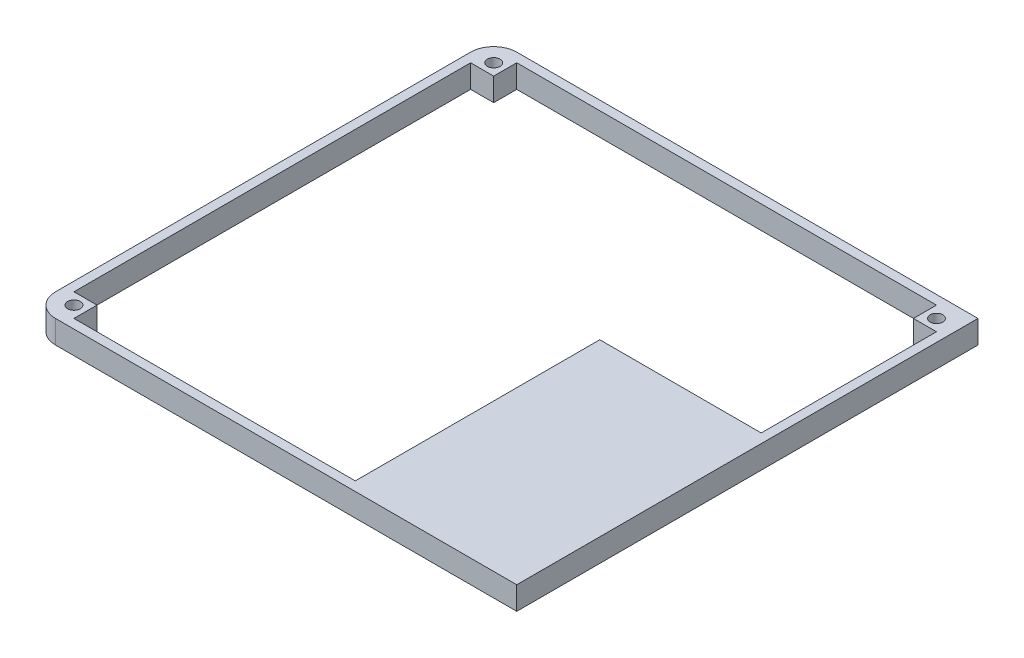
ISO-10303-21;
HEADER;
FILE_DESCRIPTION(('STEP AP214'),'2;1');
FILE_NAME('part.step','',(''),(''),'','','');
FILE_SCHEMA(('AUTOMOTIVE_DESIGN { 1 0 10303 214 1 1 1 1 }'));
ENDSEC;
DATA;
#1=APPLICATION_CONTEXT('core data for automotive mechanical design processes');
#2=APPLICATION_PROTOCOL_DEFINITION('international standard','automotive_design',2000,#1);
#3=PRODUCT_CONTEXT('',#1,'mechanical');
#4=PRODUCT('Part','Part','',(#3));
#5=PRODUCT_RELATED_PRODUCT_CATEGORY('part','',(#4));
#6=PRODUCT_DEFINITION_FORMATION('','',#4);
#7=PRODUCT_DEFINITION_CONTEXT('part definition',#1,'design');
#8=PRODUCT_DEFINITION('design','',#6,#7);
#9=PRODUCT_DEFINITION_SHAPE('','',#8);
#10=(LENGTH_UNIT() NAMED_UNIT(*) SI_UNIT(.MILLI.,.METRE.));
#11=(NAMED_UNIT(*) PLANE_ANGLE_UNIT() SI_UNIT($,.RADIAN.));
#12=(NAMED_UNIT(*) SI_UNIT($,.STERADIAN.) SOLID_ANGLE_UNIT());
#13=UNCERTAINTY_MEASURE_WITH_UNIT(LENGTH_MEASURE(1.E-05),#10,'distance_accuracy_value','');
#14=(GEOMETRIC_REPRESENTATION_CONTEXT(3) GLOBAL_UNCERTAINTY_ASSIGNED_CONTEXT((#13)) GLOBAL_UNIT_ASSIGNED_CONTEXT((#10,
#11,#12)) REPRESENTATION_CONTEXT('',''));
#15=CARTESIAN_POINT('',(0.,0.,0.));
#16=DIRECTION('',(0.,0.,1.));
#17=DIRECTION('',(1.,0.,0.));
#18=AXIS2_PLACEMENT_3D('',#15,#16,#17);
#19=CARTESIAN_POINT('',(206.,-10.,-196.));
#20=DIRECTION('',(1.,0.,0.));
#21=DIRECTION('',(0.,0.,-1.));
#22=AXIS2_PLACEMENT_3D('',#19,#20,#21);
#23=PLANE('',#22);
#24=DIRECTION('',(0.,-1.,0.));
#25=VECTOR('',#24,1.);
#26=CARTESIAN_POINT('',(206.,0.,-106.));
#27=LINE('',#26,#25);
#28=CARTESIAN_POINT('',(206.,-5.,-106.));
#29=VERTEX_POINT('',#28);
#30=CARTESIAN_POINT('',(206.,-10.,-106.));
#31=VERTEX_POINT('',#30);
#32=EDGE_CURVE('E417',#29,#31,#27,.T.);
#33=ORIENTED_EDGE('',*,*,#32,.T.);
#34=DIRECTION('',(0.,0.,-1.));
#35=VECTOR('',#34,1.);
#36=CARTESIAN_POINT('',(206.,-10.,-196.));
#37=LINE('',#36,#35);
#38=CARTESIAN_POINT('',(206.,-10.,-4.));
#39=VERTEX_POINT('',#38);
#40=EDGE_CURVE('E235',#39,#31,#37,.T.);
#41=ORIENTED_EDGE('',*,*,#40,.F.);
#42=DIRECTION('',(0.,-1.,0.));
#43=VECTOR('',#42,1.);
#44=CARTESIAN_POINT('',(206.,-5.,-4.));
#45=LINE('',#44,#43);
#46=CARTESIAN_POINT('',(206.,-5.,-4.));
#47=VERTEX_POINT('',#46);
#48=EDGE_CURVE('E252',#47,#39,#45,.T.);
#49=ORIENTED_EDGE('',*,*,#48,.F.);
#50=DIRECTION('',(0.,0.,1.));
#51=VECTOR('',#50,1.);
#52=CARTESIAN_POINT('',(206.,-5.,-4.));
#53=LINE('',#52,#51);
#54=EDGE_CURVE('E406',#29,#47,#53,.T.);
#55=ORIENTED_EDGE('',*,*,#54,.F.);
#56=EDGE_LOOP('',(#33,#41,#49,#55));
#57=FACE_BOUND('',#56,.T.);
#58=ADVANCED_FACE('F45',(#57),#23,.F.);
#59=DIRECTION('',(0.,-1.,0.));
#60=VECTOR('',#59,1.);
#61=CARTESIAN_POINT('',(206.,0.,-110.));
#62=LINE('',#61,#60);
#63=CARTESIAN_POINT('',(206.,0.,-110.));
#64=VERTEX_POINT('',#63);
#65=CARTESIAN_POINT('',(206.,-10.,-110.));
#66=VERTEX_POINT('',#65);
#67=EDGE_CURVE('E437',#64,#66,#62,.T.);
#68=ORIENTED_EDGE('',*,*,#67,.F.);
#69=DIRECTION('',(0.,0.,-1.));
#70=VECTOR('',#69,1.);
#71=CARTESIAN_POINT('',(206.,0.,-196.));
#72=LINE('',#71,#70);
#73=CARTESIAN_POINT('',(206.,0.,-186.));
#74=VERTEX_POINT('',#73);
#75=EDGE_CURVE('E255',#64,#74,#72,.T.);
#76=ORIENTED_EDGE('',*,*,#75,.T.);
#77=DIRECTION('',(0.,-1.,0.));
#78=VECTOR('',#77,1.);
#79=CARTESIAN_POINT('',(206.,0.,-186.));
#80=LINE('',#79,#78);
#81=CARTESIAN_POINT('',(206.,-10.,-186.));
#82=VERTEX_POINT('',#81);
#83=EDGE_CURVE('E506',#74,#82,#80,.T.);
#84=ORIENTED_EDGE('',*,*,#83,.T.);
#85=EDGE_CURVE('E230',#66,#82,#37,.T.);
#86=ORIENTED_EDGE('',*,*,#85,.F.);
#87=EDGE_LOOP('',(#68,#76,#84,#86));
#88=FACE_BOUND('',#87,.T.);
#89=ADVANCED_FACE('F348',(#88),#23,.F.);
#90=CARTESIAN_POINT('',(4.00000000000002,-10.,-4.));
#91=DIRECTION('',(0.,0.,1.));
#92=DIRECTION('',(1.,0.,0.));
#93=AXIS2_PLACEMENT_3D('',#90,#91,#92);
#94=PLANE('',#93);
#95=DIRECTION('',(0.,-1.,0.));
#96=VECTOR('',#95,1.);
#97=CARTESIAN_POINT('',(140.,0.,-4.));
#98=LINE('',#97,#96);
#99=CARTESIAN_POINT('',(140.,-5.,-4.));
#100=VERTEX_POINT('',#99);
#101=CARTESIAN_POINT('',(140.,-10.,-4.));
#102=VERTEX_POINT('',#101);
#103=EDGE_CURVE('E390',#100,#102,#98,.T.);
#104=ORIENTED_EDGE('',*,*,#103,.F.);
#105=DIRECTION('',(-1.,0.,0.));
#106=VECTOR('',#105,1.);
#107=CARTESIAN_POINT('',(140.,-5.,-4.));
#108=LINE('',#107,#106);
#109=EDGE_CURVE('E393',#47,#100,#108,.T.);
#110=ORIENTED_EDGE('',*,*,#109,.F.);
#111=ORIENTED_EDGE('',*,*,#48,.T.);
#112=DIRECTION('',(1.,0.,0.));
#113=VECTOR('',#112,1.);
#114=CARTESIAN_POINT('',(4.00000000000002,-10.,-4.));
#115=LINE('',#114,#113);
#116=EDGE_CURVE('E231',#102,#39,#115,.T.);
#117=ORIENTED_EDGE('',*,*,#116,.F.);
#118=EDGE_LOOP('',(#104,#110,#111,#117));
#119=FACE_BOUND('',#118,.T.);
#120=ADVANCED_FACE('F354',(#119),#94,.F.);
#121=CARTESIAN_POINT('',(0.,-10.,0.));
#122=DIRECTION('',(-1.,0.,0.));
#123=DIRECTION('',(0.,0.,1.));
#124=AXIS2_PLACEMENT_3D('',#121,#122,#123);
#125=PLANE('',#124);
#126=DIRECTION('',(0.,0.,1.));
#127=VECTOR('',#126,1.);
#128=CARTESIAN_POINT('',(0.,-10.,0.));
#129=LINE('',#128,#127);
#130=CARTESIAN_POINT('',(0.,-10.,-190.));
#131=VERTEX_POINT('',#130);
#132=CARTESIAN_POINT('',(0.,-10.,-10.));
#133=VERTEX_POINT('',#132);
#134=EDGE_CURVE('E262',#131,#133,#129,.T.);
#135=ORIENTED_EDGE('',*,*,#134,.T.);
#136=DIRECTION('',(0.,1.,0.));
#137=VECTOR('',#136,1.);
#138=CARTESIAN_POINT('',(0.,-10.,-10.));
#139=LINE('',#138,#137);
#140=CARTESIAN_POINT('',(0.,0.,-10.));
#141=VERTEX_POINT('',#140);
#142=EDGE_CURVE('E299',#133,#141,#139,.T.);
#143=ORIENTED_EDGE('',*,*,#142,.T.);
#144=DIRECTION('',(0.,0.,1.));
#145=VECTOR('',#144,1.);
#146=CARTESIAN_POINT('',(0.,0.,0.));
#147=LINE('',#146,#145);
#148=CARTESIAN_POINT('',(0.,0.,-190.));
#149=VERTEX_POINT('',#148);
#150=EDGE_CURVE('E247',#149,#141,#147,.T.);
#151=ORIENTED_EDGE('',*,*,#150,.F.);
#152=DIRECTION('',(0.,1.,0.));
#153=VECTOR('',#152,1.);
#154=CARTESIAN_POINT('',(0.,-10.,-190.));
#155=LINE('',#154,#153);
#156=EDGE_CURVE('E293',#149,#131,#155,.F.);
#157=ORIENTED_EDGE('',*,*,#156,.T.);
#158=EDGE_LOOP('',(#135,#143,#151,#157));
#159=FACE_BOUND('',#158,.T.);
#160=ADVANCED_FACE('F319',(#159),#125,.T.);
#161=CARTESIAN_POINT('',(0.,-10.,-200.));
#162=DIRECTION('',(0.,0.,-1.));
#163=DIRECTION('',(-1.,0.,0.));
#164=AXIS2_PLACEMENT_3D('',#161,#162,#163);
#165=PLANE('',#164);
#166=DIRECTION('',(-1.,0.,0.));
#167=VECTOR('',#166,1.);
#168=CARTESIAN_POINT('',(0.,-10.,-200.));
#169=LINE('',#168,#167);
#170=CARTESIAN_POINT('',(210.,-10.,-200.));
#171=VERTEX_POINT('',#170);
#172=CARTESIAN_POINT('',(10.,-10.,-200.));
#173=VERTEX_POINT('',#172);
#174=EDGE_CURVE('E273',#171,#173,#169,.T.);
#175=ORIENTED_EDGE('',*,*,#174,.T.);
#176=DIRECTION('',(0.,1.,0.));
#177=VECTOR('',#176,1.);
#178=CARTESIAN_POINT('',(10.,-10.,-200.));
#179=LINE('',#178,#177);
#180=CARTESIAN_POINT('',(10.,0.,-200.));
#181=VERTEX_POINT('',#180);
#182=EDGE_CURVE('E11',#173,#181,#179,.T.);
#183=ORIENTED_EDGE('',*,*,#182,.T.);
#184=DIRECTION('',(-1.,0.,0.));
#185=VECTOR('',#184,1.);
#186=CARTESIAN_POINT('',(0.,0.,-200.));
#187=LINE('',#186,#185);
#188=CARTESIAN_POINT('',(210.,0.,-200.));
#189=VERTEX_POINT('',#188);
#190=EDGE_CURVE('E267',#189,#181,#187,.T.);
#191=ORIENTED_EDGE('',*,*,#190,.F.);
#192=DIRECTION('',(0.,1.,0.));
#193=VECTOR('',#192,1.);
#194=CARTESIAN_POINT('',(210.,-10.,-200.));
#195=LINE('',#194,#193);
#196=EDGE_CURVE('E289',#171,#189,#195,.T.);
#197=ORIENTED_EDGE('',*,*,#196,.F.);
#198=EDGE_LOOP('',(#175,#183,#191,#197));
#199=FACE_BOUND('',#198,.T.);
#200=ADVANCED_FACE('F334',(#199),#165,.T.);
#201=CARTESIAN_POINT('',(210.,-10.,0.));
#202=DIRECTION('',(1.,0.,0.));
#203=DIRECTION('',(0.,0.,-1.));
#204=AXIS2_PLACEMENT_3D('',#201,#202,#203);
#205=PLANE('',#204);
#206=ORIENTED_EDGE('',*,*,#196,.T.);
#207=DIRECTION('',(0.,0.,-1.));
#208=VECTOR('',#207,1.);
#209=CARTESIAN_POINT('',(210.,0.,0.));
#210=LINE('',#209,#208);
#211=CARTESIAN_POINT('',(210.,0.,0.));
#212=VERTEX_POINT('',#211);
#213=EDGE_CURVE('E283',#212,#189,#210,.T.);
#214=ORIENTED_EDGE('',*,*,#213,.F.);
#215=DIRECTION('',(0.,1.,0.));
#216=VECTOR('',#215,1.);
#217=CARTESIAN_POINT('',(210.,-10.,0.));
#218=LINE('',#217,#216);
#219=CARTESIAN_POINT('',(210.,-10.,0.));
#220=VERTEX_POINT('',#219);
#221=EDGE_CURVE('E276',#220,#212,#218,.T.);
#222=ORIENTED_EDGE('',*,*,#221,.F.);
#223=DIRECTION('',(0.,0.,-1.));
#224=VECTOR('',#223,1.);
#225=CARTESIAN_POINT('',(210.,-10.,0.));
#226=LINE('',#225,#224);
#227=EDGE_CURVE('E270',#220,#171,#226,.T.);
#228=ORIENTED_EDGE('',*,*,#227,.T.);
#229=EDGE_LOOP('',(#206,#214,#222,#228));
#230=FACE_BOUND('',#229,.T.);
#231=ADVANCED_FACE('F330',(#230),#205,.T.);
#232=CARTESIAN_POINT('',(0.,-10.,0.));
#233=DIRECTION('',(0.,0.,1.));
#234=DIRECTION('',(1.,0.,0.));
#235=AXIS2_PLACEMENT_3D('',#232,#233,#234);
#236=PLANE('',#235);
#237=DIRECTION('',(1.,0.,0.));
#238=VECTOR('',#237,1.);
#239=CARTESIAN_POINT('',(0.,0.,0.));
#240=LINE('',#239,#238);
#241=CARTESIAN_POINT('',(10.,0.,0.));
#242=VERTEX_POINT('',#241);
#243=EDGE_CURVE('E280',#242,#212,#240,.T.);
#244=ORIENTED_EDGE('',*,*,#243,.F.);
#245=DIRECTION('',(0.,1.,0.));
#246=VECTOR('',#245,1.);
#247=CARTESIAN_POINT('',(10.,-10.,0.));
#248=LINE('',#247,#246);
#249=CARTESIAN_POINT('',(10.,-10.,0.));
#250=VERTEX_POINT('',#249);
#251=EDGE_CURVE('E69',#242,#250,#248,.F.);
#252=ORIENTED_EDGE('',*,*,#251,.T.);
#253=DIRECTION('',(1.,0.,0.));
#254=VECTOR('',#253,1.);
#255=CARTESIAN_POINT('',(0.,-10.,0.));
#256=LINE('',#255,#254);
#257=EDGE_CURVE('E266',#250,#220,#256,.T.);
#258=ORIENTED_EDGE('',*,*,#257,.T.);
#259=ORIENTED_EDGE('',*,*,#221,.T.);
#260=EDGE_LOOP('',(#244,#252,#258,#259));
#261=FACE_BOUND('',#260,.T.);
#262=ADVANCED_FACE('F326',(#261),#236,.T.);
#263=CARTESIAN_POINT('',(0.,-10.,0.));
#264=DIRECTION('',(0.,-1.,0.));
#265=DIRECTION('',(0.,0.,-1.));
#266=AXIS2_PLACEMENT_3D('',#263,#264,#265);
#267=PLANE('',#266);
#268=DIRECTION('',(-1.,0.,0.));
#269=VECTOR('',#268,1.);
#270=CARTESIAN_POINT('',(0.,-10.,-110.));
#271=LINE('',#270,#269);
#272=CARTESIAN_POINT('',(136.,-10.,-110.));
#273=VERTEX_POINT('',#272);
#274=EDGE_CURVE('E210',#66,#273,#271,.T.);
#275=ORIENTED_EDGE('',*,*,#274,.F.);
#276=ORIENTED_EDGE('',*,*,#85,.T.);
#277=DIRECTION('',(-1.,0.,0.));
#278=VECTOR('',#277,1.);
#279=CARTESIAN_POINT('',(206.,-10.,-186.));
#280=LINE('',#279,#278);
#281=CARTESIAN_POINT('',(196.,-10.,-186.));
#282=VERTEX_POINT('',#281);
#283=EDGE_CURVE('E520',#82,#282,#280,.T.);
#284=ORIENTED_EDGE('',*,*,#283,.T.);
#285=DIRECTION('',(0.,0.,-1.));
#286=VECTOR('',#285,1.);
#287=CARTESIAN_POINT('',(196.,-10.,-196.));
#288=LINE('',#287,#286);
#289=CARTESIAN_POINT('',(196.,-10.,-196.));
#290=VERTEX_POINT('',#289);
#291=EDGE_CURVE('E516',#282,#290,#288,.T.);
#292=ORIENTED_EDGE('',*,*,#291,.T.);
#293=DIRECTION('',(-1.,0.,0.));
#294=VECTOR('',#293,1.);
#295=CARTESIAN_POINT('',(4.,-10.,-196.));
#296=LINE('',#295,#294);
#297=CARTESIAN_POINT('',(14.,-10.,-196.));
#298=VERTEX_POINT('',#297);
#299=EDGE_CURVE('E243',#290,#298,#296,.T.);
#300=ORIENTED_EDGE('',*,*,#299,.T.);
#301=DIRECTION('',(0.,0.,1.));
#302=VECTOR('',#301,1.);
#303=CARTESIAN_POINT('',(14.,-10.,-196.));
#304=LINE('',#303,#302);
#305=CARTESIAN_POINT('',(14.,-10.,-186.));
#306=VERTEX_POINT('',#305);
#307=EDGE_CURVE('E489',#298,#306,#304,.T.);
#308=ORIENTED_EDGE('',*,*,#307,.T.);
#309=DIRECTION('',(-1.,0.,0.));
#310=VECTOR('',#309,1.);
#311=CARTESIAN_POINT('',(4.,-10.,-186.));
#312=LINE('',#311,#310);
#313=CARTESIAN_POINT('',(4.,-10.,-186.));
#314=VERTEX_POINT('',#313);
#315=EDGE_CURVE('E485',#306,#314,#312,.T.);
#316=ORIENTED_EDGE('',*,*,#315,.T.);
#317=DIRECTION('',(0.,0.,1.));
#318=VECTOR('',#317,1.);
#319=CARTESIAN_POINT('',(4.,-10.,-196.));
#320=LINE('',#319,#318);
#321=CARTESIAN_POINT('',(4.00000000000002,-10.,-14.));
#322=VERTEX_POINT('',#321);
#323=EDGE_CURVE('E237',#314,#322,#320,.T.);
#324=ORIENTED_EDGE('',*,*,#323,.T.);
#325=DIRECTION('',(1.,0.,0.));
#326=VECTOR('',#325,1.);
#327=CARTESIAN_POINT('',(4.00000000000002,-10.,-14.));
#328=LINE('',#327,#326);
#329=CARTESIAN_POINT('',(14.,-10.,-14.));
#330=VERTEX_POINT('',#329);
#331=EDGE_CURVE('E446',#322,#330,#328,.T.);
#332=ORIENTED_EDGE('',*,*,#331,.T.);
#333=DIRECTION('',(0.,0.,1.));
#334=VECTOR('',#333,1.);
#335=CARTESIAN_POINT('',(14.,-10.,-4.));
#336=LINE('',#335,#334);
#337=CARTESIAN_POINT('',(14.,-10.,-4.));
#338=VERTEX_POINT('',#337);
#339=EDGE_CURVE('E227',#330,#338,#336,.T.);
#340=ORIENTED_EDGE('',*,*,#339,.T.);
#341=CARTESIAN_POINT('',(136.,-10.,-4.00000000000001));
#342=VERTEX_POINT('',#341);
#343=EDGE_CURVE('E217',#338,#342,#115,.T.);
#344=ORIENTED_EDGE('',*,*,#343,.T.);
#345=DIRECTION('',(0.,0.,-1.));
#346=VECTOR('',#345,1.);
#347=CARTESIAN_POINT('',(136.,-10.,0.));
#348=LINE('',#347,#346);
#349=EDGE_CURVE('E197',#342,#273,#348,.T.);
#350=ORIENTED_EDGE('',*,*,#349,.T.);
#351=EDGE_LOOP('',(#275,#276,#284,#292,#300,#308,#316,#324,#332,#340,#344,#350));
#352=FACE_BOUND('',#351,.T.);
#353=ORIENTED_EDGE('',*,*,#40,.T.);
#354=DIRECTION('',(1.,0.,0.));
#355=VECTOR('',#354,1.);
#356=CARTESIAN_POINT('',(0.,-10.,-106.));
#357=LINE('',#356,#355);
#358=CARTESIAN_POINT('',(140.,-10.,-106.));
#359=VERTEX_POINT('',#358);
#360=EDGE_CURVE('E419',#359,#31,#357,.T.);
#361=ORIENTED_EDGE('',*,*,#360,.F.);
#362=DIRECTION('',(0.,0.,-1.));
#363=VECTOR('',#362,1.);
#364=CARTESIAN_POINT('',(140.,-10.,0.));
#365=LINE('',#364,#363);
#366=EDGE_CURVE('E420',#102,#359,#365,.T.);
#367=ORIENTED_EDGE('',*,*,#366,.F.);
#368=ORIENTED_EDGE('',*,*,#116,.T.);
#369=EDGE_LOOP('',(#353,#361,#367,#368));
#370=FACE_BOUND('',#369,.T.);
#371=ORIENTED_EDGE('',*,*,#257,.F.);
#372=CARTESIAN_POINT('',(10.,-10.,-10.));
#373=DIRECTION('',(0.,-1.,0.));
#374=DIRECTION('',(0.,0.,-1.));
#375=AXIS2_PLACEMENT_3D('',#372,#373,#374);
#376=CIRCLE('',#375,10.);
#377=EDGE_CURVE('E54',#250,#133,#376,.T.);
#378=ORIENTED_EDGE('',*,*,#377,.T.);
#379=ORIENTED_EDGE('',*,*,#134,.F.);
#380=CARTESIAN_POINT('',(10.,-10.,-190.));
#381=DIRECTION('',(0.,-1.,0.));
#382=DIRECTION('',(0.,0.,-1.));
#383=AXIS2_PLACEMENT_3D('',#380,#381,#382);
#384=CIRCLE('',#383,10.);
#385=EDGE_CURVE('E61',#131,#173,#384,.T.);
#386=ORIENTED_EDGE('',*,*,#385,.T.);
#387=ORIENTED_EDGE('',*,*,#174,.F.);
#388=ORIENTED_EDGE('',*,*,#227,.F.);
#389=EDGE_LOOP('',(#371,#378,#379,#386,#387,#388));
#390=FACE_BOUND('',#389,.T.);
#391=CARTESIAN_POINT('',(9.00000000000002,-10.,-9.00000000000001));
#392=DIRECTION('',(0.,-1.,0.));
#393=DIRECTION('',(0.,0.,-1.));
#394=AXIS2_PLACEMENT_3D('',#391,#392,#393);
#395=CIRCLE('',#394,2.75);
#396=CARTESIAN_POINT('',(9.00000000000002,-10.,-11.75));
#397=VERTEX_POINT('',#396);
#398=EDGE_CURVE('E447',#397,#397,#395,.T.);
#399=ORIENTED_EDGE('',*,*,#398,.F.);
#400=EDGE_LOOP('',(#399));
#401=FACE_BOUND('',#400,.T.);
#402=CARTESIAN_POINT('',(201.,-10.,-191.));
#403=DIRECTION('',(0.,-1.,0.));
#404=DIRECTION('',(0.,0.,-1.));
#405=AXIS2_PLACEMENT_3D('',#402,#403,#404);
#406=CIRCLE('',#405,2.75000000000001);
#407=CARTESIAN_POINT('',(201.,-10.,-193.75));
#408=VERTEX_POINT('',#407);
#409=EDGE_CURVE('E484',#408,#408,#406,.T.);
#410=ORIENTED_EDGE('',*,*,#409,.F.);
#411=EDGE_LOOP('',(#410));
#412=FACE_BOUND('',#411,.T.);
#413=CARTESIAN_POINT('',(9.00000000000002,-10.,-191.));
#414=DIRECTION('',(0.,-1.,0.));
#415=DIRECTION('',(0.,0.,-1.));
#416=AXIS2_PLACEMENT_3D('',#413,#414,#415);
#417=CIRCLE('',#416,2.75);
#418=CARTESIAN_POINT('',(9.00000000000002,-10.,-193.75));
#419=VERTEX_POINT('',#418);
#420=EDGE_CURVE('E451',#419,#419,#417,.T.);
#421=ORIENTED_EDGE('',*,*,#420,.F.);
#422=EDGE_LOOP('',(#421));
#423=FACE_BOUND('',#422,.T.);
#424=ADVANCED_FACE('F223',(#352,#370,#390,#401,#412,#423),#267,.T.);
#425=CARTESIAN_POINT('',(0.,0.,0.));
#426=DIRECTION('',(0.,-1.,0.));
#427=DIRECTION('',(0.,0.,-1.));
#428=AXIS2_PLACEMENT_3D('',#425,#426,#427);
#429=PLANE('',#428);
#430=ORIENTED_EDGE('',*,*,#75,.F.);
#431=DIRECTION('',(-1.,0.,0.));
#432=VECTOR('',#431,1.);
#433=CARTESIAN_POINT('',(0.,0.,-110.));
#434=LINE('',#433,#432);
#435=CARTESIAN_POINT('',(136.,0.,-110.));
#436=VERTEX_POINT('',#435);
#437=EDGE_CURVE('E221',#64,#436,#434,.T.);
#438=ORIENTED_EDGE('',*,*,#437,.T.);
#439=DIRECTION('',(0.,0.,-1.));
#440=VECTOR('',#439,1.);
#441=CARTESIAN_POINT('',(136.,0.,0.));
#442=LINE('',#441,#440);
#443=CARTESIAN_POINT('',(136.,0.,-4.00000000000001));
#444=VERTEX_POINT('',#443);
#445=EDGE_CURVE('E423',#444,#436,#442,.T.);
#446=ORIENTED_EDGE('',*,*,#445,.F.);
#447=DIRECTION('',(1.,0.,0.));
#448=VECTOR('',#447,1.);
#449=CARTESIAN_POINT('',(4.00000000000002,0.,-4.));
#450=LINE('',#449,#448);
#451=CARTESIAN_POINT('',(14.,0.,-4.));
#452=VERTEX_POINT('',#451);
#453=EDGE_CURVE('E219',#452,#444,#450,.T.);
#454=ORIENTED_EDGE('',*,*,#453,.F.);
#455=DIRECTION('',(0.,0.,1.));
#456=VECTOR('',#455,1.);
#457=CARTESIAN_POINT('',(14.,0.,-4.));
#458=LINE('',#457,#456);
#459=CARTESIAN_POINT('',(14.,0.,-14.));
#460=VERTEX_POINT('',#459);
#461=EDGE_CURVE('E456',#460,#452,#458,.T.);
#462=ORIENTED_EDGE('',*,*,#461,.F.);
#463=DIRECTION('',(1.,0.,0.));
#464=VECTOR('',#463,1.);
#465=CARTESIAN_POINT('',(4.00000000000002,0.,-14.));
#466=LINE('',#465,#464);
#467=CARTESIAN_POINT('',(4.00000000000002,0.,-14.));
#468=VERTEX_POINT('',#467);
#469=EDGE_CURVE('E452',#468,#460,#466,.T.);
#470=ORIENTED_EDGE('',*,*,#469,.F.);
#471=DIRECTION('',(0.,0.,1.));
#472=VECTOR('',#471,1.);
#473=CARTESIAN_POINT('',(4.,0.,-196.));
#474=LINE('',#473,#472);
#475=CARTESIAN_POINT('',(4.,0.,-186.));
#476=VERTEX_POINT('',#475);
#477=EDGE_CURVE('E248',#476,#468,#474,.T.);
#478=ORIENTED_EDGE('',*,*,#477,.F.);
#479=DIRECTION('',(-1.,0.,0.));
#480=VECTOR('',#479,1.);
#481=CARTESIAN_POINT('',(4.,0.,-186.));
#482=LINE('',#481,#480);
#483=CARTESIAN_POINT('',(14.,0.,-186.));
#484=VERTEX_POINT('',#483);
#485=EDGE_CURVE('E477',#484,#476,#482,.T.);
#486=ORIENTED_EDGE('',*,*,#485,.F.);
#487=DIRECTION('',(0.,0.,1.));
#488=VECTOR('',#487,1.);
#489=CARTESIAN_POINT('',(14.,0.,-196.));
#490=LINE('',#489,#488);
#491=CARTESIAN_POINT('',(14.,0.,-196.));
#492=VERTEX_POINT('',#491);
#493=EDGE_CURVE('E490',#492,#484,#490,.T.);
#494=ORIENTED_EDGE('',*,*,#493,.F.);
#495=DIRECTION('',(-1.,0.,0.));
#496=VECTOR('',#495,1.);
#497=CARTESIAN_POINT('',(4.,0.,-196.));
#498=LINE('',#497,#496);
#499=CARTESIAN_POINT('',(196.,0.,-196.));
#500=VERTEX_POINT('',#499);
#501=EDGE_CURVE('E258',#500,#492,#498,.T.);
#502=ORIENTED_EDGE('',*,*,#501,.F.);
#503=DIRECTION('',(0.,0.,-1.));
#504=VECTOR('',#503,1.);
#505=CARTESIAN_POINT('',(196.,0.,-196.));
#506=LINE('',#505,#504);
#507=CARTESIAN_POINT('',(196.,0.,-186.));
#508=VERTEX_POINT('',#507);
#509=EDGE_CURVE('E510',#508,#500,#506,.T.);
#510=ORIENTED_EDGE('',*,*,#509,.F.);
#511=DIRECTION('',(-1.,0.,0.));
#512=VECTOR('',#511,1.);
#513=CARTESIAN_POINT('',(206.,0.,-186.));
#514=LINE('',#513,#512);
#515=EDGE_CURVE('E521',#74,#508,#514,.T.);
#516=ORIENTED_EDGE('',*,*,#515,.F.);
#517=EDGE_LOOP('',(#430,#438,#446,#454,#462,#470,#478,#486,#494,#502,#510,#516));
#518=FACE_BOUND('',#517,.T.);
#519=ORIENTED_EDGE('',*,*,#150,.T.);
#520=CARTESIAN_POINT('',(10.,0.,-10.));
#521=DIRECTION('',(0.,-1.,0.));
#522=DIRECTION('',(0.,0.,-1.));
#523=AXIS2_PLACEMENT_3D('',#520,#521,#522);
#524=CIRCLE('',#523,10.);
#525=EDGE_CURVE('E306',#141,#242,#524,.F.);
#526=ORIENTED_EDGE('',*,*,#525,.T.);
#527=ORIENTED_EDGE('',*,*,#243,.T.);
#528=ORIENTED_EDGE('',*,*,#213,.T.);
#529=ORIENTED_EDGE('',*,*,#190,.T.);
#530=CARTESIAN_POINT('',(10.,0.,-190.));
#531=DIRECTION('',(0.,-1.,0.));
#532=DIRECTION('',(0.,0.,-1.));
#533=AXIS2_PLACEMENT_3D('',#530,#531,#532);
#534=CIRCLE('',#533,10.);
#535=EDGE_CURVE('E303',#181,#149,#534,.F.);
#536=ORIENTED_EDGE('',*,*,#535,.T.);
#537=EDGE_LOOP('',(#519,#526,#527,#528,#529,#536));
#538=FACE_BOUND('',#537,.T.);
#539=CARTESIAN_POINT('',(9.00000000000002,0.,-9.00000000000001));
#540=DIRECTION('',(0.,-1.,0.));
#541=DIRECTION('',(0.,0.,-1.));
#542=AXIS2_PLACEMENT_3D('',#539,#540,#541);
#543=CIRCLE('',#542,2.75);
#544=CARTESIAN_POINT('',(9.00000000000002,0.,-11.75));
#545=VERTEX_POINT('',#544);
#546=EDGE_CURVE('E442',#545,#545,#543,.T.);
#547=ORIENTED_EDGE('',*,*,#546,.T.);
#548=EDGE_LOOP('',(#547));
#549=FACE_BOUND('',#548,.T.);
#550=CARTESIAN_POINT('',(201.,0.,-191.));
#551=DIRECTION('',(0.,-1.,0.));
#552=DIRECTION('',(0.,0.,-1.));
#553=AXIS2_PLACEMENT_3D('',#550,#551,#552);
#554=CIRCLE('',#553,2.75000000000001);
#555=CARTESIAN_POINT('',(201.,0.,-193.75));
#556=VERTEX_POINT('',#555);
#557=EDGE_CURVE('E525',#556,#556,#554,.T.);
#558=ORIENTED_EDGE('',*,*,#557,.T.);
#559=EDGE_LOOP('',(#558));
#560=FACE_BOUND('',#559,.T.);
#561=CARTESIAN_POINT('',(9.00000000000002,0.,-191.));
#562=DIRECTION('',(0.,-1.,0.));
#563=DIRECTION('',(0.,0.,-1.));
#564=AXIS2_PLACEMENT_3D('',#561,#562,#563);
#565=CIRCLE('',#564,2.75);
#566=CARTESIAN_POINT('',(9.00000000000002,0.,-193.75));
#567=VERTEX_POINT('',#566);
#568=EDGE_CURVE('E494',#567,#567,#565,.T.);
#569=ORIENTED_EDGE('',*,*,#568,.T.);
#570=EDGE_LOOP('',(#569));
#571=FACE_BOUND('',#570,.T.);
#572=ADVANCED_FACE('F324',(#518,#538,#549,#560,#571),#429,.F.);
#573=CARTESIAN_POINT('',(4.,-10.,-196.));
#574=DIRECTION('',(-1.,0.,0.));
#575=DIRECTION('',(0.,0.,1.));
#576=AXIS2_PLACEMENT_3D('',#573,#574,#575);
#577=PLANE('',#576);
#578=ORIENTED_EDGE('',*,*,#477,.T.);
#579=DIRECTION('',(0.,-1.,0.));
#580=VECTOR('',#579,1.);
#581=CARTESIAN_POINT('',(4.00000000000002,0.,-14.));
#582=LINE('',#581,#580);
#583=EDGE_CURVE('E459',#468,#322,#582,.T.);
#584=ORIENTED_EDGE('',*,*,#583,.T.);
#585=ORIENTED_EDGE('',*,*,#323,.F.);
#586=DIRECTION('',(0.,-1.,0.));
#587=VECTOR('',#586,1.);
#588=CARTESIAN_POINT('',(4.,0.,-186.));
#589=LINE('',#588,#587);
#590=EDGE_CURVE('E481',#476,#314,#589,.T.);
#591=ORIENTED_EDGE('',*,*,#590,.F.);
#592=EDGE_LOOP('',(#578,#584,#585,#591));
#593=FACE_BOUND('',#592,.T.);
#594=ADVANCED_FACE('F364',(#593),#577,.F.);
#595=CARTESIAN_POINT('',(4.,-10.,-196.));
#596=DIRECTION('',(0.,0.,-1.));
#597=DIRECTION('',(-1.,0.,0.));
#598=AXIS2_PLACEMENT_3D('',#595,#596,#597);
#599=PLANE('',#598);
#600=ORIENTED_EDGE('',*,*,#501,.T.);
#601=DIRECTION('',(0.,-1.,0.));
#602=VECTOR('',#601,1.);
#603=CARTESIAN_POINT('',(14.,0.,-196.));
#604=LINE('',#603,#602);
#605=EDGE_CURVE('E473',#492,#298,#604,.T.);
#606=ORIENTED_EDGE('',*,*,#605,.T.);
#607=ORIENTED_EDGE('',*,*,#299,.F.);
#608=DIRECTION('',(0.,-1.,0.));
#609=VECTOR('',#608,1.);
#610=CARTESIAN_POINT('',(196.,0.,-196.));
#611=LINE('',#610,#609);
#612=EDGE_CURVE('E398',#500,#290,#611,.T.);
#613=ORIENTED_EDGE('',*,*,#612,.F.);
#614=EDGE_LOOP('',(#600,#606,#607,#613));
#615=FACE_BOUND('',#614,.T.);
#616=ADVANCED_FACE('F359',(#615),#599,.F.);
#617=ORIENTED_EDGE('',*,*,#453,.T.);
#618=DIRECTION('',(0.,-1.,0.));
#619=VECTOR('',#618,1.);
#620=CARTESIAN_POINT('',(136.,0.,-4.00000000000001));
#621=LINE('',#620,#619);
#622=EDGE_CURVE('E201',#444,#342,#621,.T.);
#623=ORIENTED_EDGE('',*,*,#622,.T.);
#624=ORIENTED_EDGE('',*,*,#343,.F.);
#625=DIRECTION('',(0.,-1.,0.));
#626=VECTOR('',#625,1.);
#627=CARTESIAN_POINT('',(14.,0.,-4.));
#628=LINE('',#627,#626);
#629=EDGE_CURVE('E464',#452,#338,#628,.T.);
#630=ORIENTED_EDGE('',*,*,#629,.F.);
#631=EDGE_LOOP('',(#617,#623,#624,#630));
#632=FACE_BOUND('',#631,.T.);
#633=ADVANCED_FACE('F215',(#632),#94,.F.);
#634=CARTESIAN_POINT('',(0.,-5.,0.));
#635=DIRECTION('',(0.,1.,0.));
#636=DIRECTION('',(0.,0.,1.));
#637=AXIS2_PLACEMENT_3D('',#634,#635,#636);
#638=PLANE('',#637);
#639=DIRECTION('',(1.,0.,0.));
#640=VECTOR('',#639,1.);
#641=CARTESIAN_POINT('',(140.,-5.,-106.));
#642=LINE('',#641,#640);
#643=CARTESIAN_POINT('',(140.,-5.,-106.));
#644=VERTEX_POINT('',#643);
#645=EDGE_CURVE('E412',#644,#29,#642,.T.);
#646=ORIENTED_EDGE('',*,*,#645,.T.);
#647=ORIENTED_EDGE('',*,*,#54,.T.);
#648=ORIENTED_EDGE('',*,*,#109,.T.);
#649=DIRECTION('',(0.,0.,-1.));
#650=VECTOR('',#649,1.);
#651=CARTESIAN_POINT('',(140.,-5.,-4.));
#652=LINE('',#651,#650);
#653=EDGE_CURVE('E404',#100,#644,#652,.T.);
#654=ORIENTED_EDGE('',*,*,#653,.T.);
#655=EDGE_LOOP('',(#646,#647,#648,#654));
#656=FACE_BOUND('',#655,.T.);
#657=ADVANCED_FACE('F363',(#656),#638,.F.);
#658=CARTESIAN_POINT('',(14.,0.,-4.));
#659=DIRECTION('',(1.,0.,0.));
#660=DIRECTION('',(0.,0.,-1.));
#661=AXIS2_PLACEMENT_3D('',#658,#659,#660);
#662=PLANE('',#661);
#663=ORIENTED_EDGE('',*,*,#339,.F.);
#664=DIRECTION('',(0.,-1.,0.));
#665=VECTOR('',#664,1.);
#666=CARTESIAN_POINT('',(14.,0.,-14.));
#667=LINE('',#666,#665);
#668=EDGE_CURVE('E467',#460,#330,#667,.T.);
#669=ORIENTED_EDGE('',*,*,#668,.F.);
#670=ORIENTED_EDGE('',*,*,#461,.T.);
#671=ORIENTED_EDGE('',*,*,#629,.T.);
#672=EDGE_LOOP('',(#663,#669,#670,#671));
#673=FACE_BOUND('',#672,.T.);
#674=ADVANCED_FACE('F555',(#673),#662,.T.);
#675=CARTESIAN_POINT('',(4.00000000000002,0.,-14.));
#676=DIRECTION('',(0.,0.,-1.));
#677=DIRECTION('',(-1.,0.,0.));
#678=AXIS2_PLACEMENT_3D('',#675,#676,#677);
#679=PLANE('',#678);
#680=ORIENTED_EDGE('',*,*,#331,.F.);
#681=ORIENTED_EDGE('',*,*,#583,.F.);
#682=ORIENTED_EDGE('',*,*,#469,.T.);
#683=ORIENTED_EDGE('',*,*,#668,.T.);
#684=EDGE_LOOP('',(#680,#681,#682,#683));
#685=FACE_BOUND('',#684,.T.);
#686=ADVANCED_FACE('F553',(#685),#679,.T.);
#687=CARTESIAN_POINT('',(9.00000000000002,0.,-9.00000000000001));
#688=DIRECTION('',(0.,-1.,0.));
#689=DIRECTION('',(0.,0.,-1.));
#690=AXIS2_PLACEMENT_3D('',#687,#688,#689);
#691=CYLINDRICAL_SURFACE('',#690,2.75);
#692=ORIENTED_EDGE('',*,*,#546,.F.);
#693=EDGE_LOOP('',(#692));
#694=FACE_BOUND('',#693,.T.);
#695=ORIENTED_EDGE('',*,*,#398,.T.);
#696=EDGE_LOOP('',(#695));
#697=FACE_BOUND('',#696,.T.);
#698=ADVANCED_FACE('F549',(#694,#697),#691,.F.);
#699=CARTESIAN_POINT('',(196.,0.,-196.));
#700=DIRECTION('',(-1.,0.,0.));
#701=DIRECTION('',(0.,0.,1.));
#702=AXIS2_PLACEMENT_3D('',#699,#700,#701);
#703=PLANE('',#702);
#704=ORIENTED_EDGE('',*,*,#291,.F.);
#705=DIRECTION('',(0.,-1.,0.));
#706=VECTOR('',#705,1.);
#707=CARTESIAN_POINT('',(196.,0.,-186.));
#708=LINE('',#707,#706);
#709=EDGE_CURVE('E511',#508,#282,#708,.T.);
#710=ORIENTED_EDGE('',*,*,#709,.F.);
#711=ORIENTED_EDGE('',*,*,#509,.T.);
#712=ORIENTED_EDGE('',*,*,#612,.T.);
#713=EDGE_LOOP('',(#704,#710,#711,#712));
#714=FACE_BOUND('',#713,.T.);
#715=ADVANCED_FACE('F552',(#714),#703,.T.);
#716=CARTESIAN_POINT('',(206.,0.,-186.));
#717=DIRECTION('',(0.,0.,1.));
#718=DIRECTION('',(1.,0.,0.));
#719=AXIS2_PLACEMENT_3D('',#716,#717,#718);
#720=PLANE('',#719);
#721=ORIENTED_EDGE('',*,*,#283,.F.);
#722=ORIENTED_EDGE('',*,*,#83,.F.);
#723=ORIENTED_EDGE('',*,*,#515,.T.);
#724=ORIENTED_EDGE('',*,*,#709,.T.);
#725=EDGE_LOOP('',(#721,#722,#723,#724));
#726=FACE_BOUND('',#725,.T.);
#727=ADVANCED_FACE('F573',(#726),#720,.T.);
#728=CARTESIAN_POINT('',(201.,0.,-191.));
#729=DIRECTION('',(0.,-1.,0.));
#730=DIRECTION('',(0.,0.,-1.));
#731=AXIS2_PLACEMENT_3D('',#728,#729,#730);
#732=CYLINDRICAL_SURFACE('',#731,2.75000000000001);
#733=ORIENTED_EDGE('',*,*,#557,.F.);
#734=EDGE_LOOP('',(#733));
#735=FACE_BOUND('',#734,.T.);
#736=ORIENTED_EDGE('',*,*,#409,.T.);
#737=EDGE_LOOP('',(#736));
#738=FACE_BOUND('',#737,.T.);
#739=ADVANCED_FACE('F569',(#735,#738),#732,.F.);
#740=CARTESIAN_POINT('',(4.,0.,-186.));
#741=DIRECTION('',(0.,0.,1.));
#742=DIRECTION('',(1.,0.,0.));
#743=AXIS2_PLACEMENT_3D('',#740,#741,#742);
#744=PLANE('',#743);
#745=ORIENTED_EDGE('',*,*,#315,.F.);
#746=DIRECTION('',(0.,-1.,0.));
#747=VECTOR('',#746,1.);
#748=CARTESIAN_POINT('',(14.,0.,-186.));
#749=LINE('',#748,#747);
#750=EDGE_CURVE('E478',#484,#306,#749,.T.);
#751=ORIENTED_EDGE('',*,*,#750,.F.);
#752=ORIENTED_EDGE('',*,*,#485,.T.);
#753=ORIENTED_EDGE('',*,*,#590,.T.);
#754=EDGE_LOOP('',(#745,#751,#752,#753));
#755=FACE_BOUND('',#754,.T.);
#756=ADVANCED_FACE('F565',(#755),#744,.T.);
#757=CARTESIAN_POINT('',(14.,0.,-196.));
#758=DIRECTION('',(1.,0.,0.));
#759=DIRECTION('',(0.,0.,-1.));
#760=AXIS2_PLACEMENT_3D('',#757,#758,#759);
#761=PLANE('',#760);
#762=ORIENTED_EDGE('',*,*,#307,.F.);
#763=ORIENTED_EDGE('',*,*,#605,.F.);
#764=ORIENTED_EDGE('',*,*,#493,.T.);
#765=ORIENTED_EDGE('',*,*,#750,.T.);
#766=EDGE_LOOP('',(#762,#763,#764,#765));
#767=FACE_BOUND('',#766,.T.);
#768=ADVANCED_FACE('F562',(#767),#761,.T.);
#769=CARTESIAN_POINT('',(9.00000000000002,0.,-191.));
#770=DIRECTION('',(0.,-1.,0.));
#771=DIRECTION('',(0.,0.,-1.));
#772=AXIS2_PLACEMENT_3D('',#769,#770,#771);
#773=CYLINDRICAL_SURFACE('',#772,2.75);
#774=ORIENTED_EDGE('',*,*,#568,.F.);
#775=EDGE_LOOP('',(#774));
#776=FACE_BOUND('',#775,.T.);
#777=ORIENTED_EDGE('',*,*,#420,.T.);
#778=EDGE_LOOP('',(#777));
#779=FACE_BOUND('',#778,.T.);
#780=ADVANCED_FACE('F347',(#776,#779),#773,.F.);
#781=CARTESIAN_POINT('',(10.,-10.,-10.));
#782=DIRECTION('',(0.,1.,0.));
#783=DIRECTION('',(0.,0.,1.));
#784=AXIS2_PLACEMENT_3D('',#781,#782,#783);
#785=CYLINDRICAL_SURFACE('',#784,10.);
#786=ORIENTED_EDGE('',*,*,#377,.F.);
#787=ORIENTED_EDGE('',*,*,#251,.F.);
#788=ORIENTED_EDGE('',*,*,#525,.F.);
#789=ORIENTED_EDGE('',*,*,#142,.F.);
#790=EDGE_LOOP('',(#786,#787,#788,#789));
#791=FACE_BOUND('',#790,.T.);
#792=ADVANCED_FACE('F322',(#791),#785,.T.);
#793=CARTESIAN_POINT('',(10.,-10.,-190.));
#794=DIRECTION('',(0.,1.,0.));
#795=DIRECTION('',(0.,0.,1.));
#796=AXIS2_PLACEMENT_3D('',#793,#794,#795);
#797=CYLINDRICAL_SURFACE('',#796,10.);
#798=ORIENTED_EDGE('',*,*,#385,.F.);
#799=ORIENTED_EDGE('',*,*,#156,.F.);
#800=ORIENTED_EDGE('',*,*,#535,.F.);
#801=ORIENTED_EDGE('',*,*,#182,.F.);
#802=EDGE_LOOP('',(#798,#799,#800,#801));
#803=FACE_BOUND('',#802,.T.);
#804=ADVANCED_FACE('F47',(#803),#797,.T.);
#805=CARTESIAN_POINT('',(140.,0.,0.));
#806=DIRECTION('',(-1.,0.,0.));
#807=DIRECTION('',(0.,0.,1.));
#808=AXIS2_PLACEMENT_3D('',#805,#806,#807);
#809=PLANE('',#808);
#810=DIRECTION('',(0.,-1.,0.));
#811=VECTOR('',#810,1.);
#812=CARTESIAN_POINT('',(140.,0.,-106.));
#813=LINE('',#812,#811);
#814=EDGE_CURVE('E399',#644,#359,#813,.T.);
#815=ORIENTED_EDGE('',*,*,#814,.F.);
#816=ORIENTED_EDGE('',*,*,#653,.F.);
#817=ORIENTED_EDGE('',*,*,#103,.T.);
#818=ORIENTED_EDGE('',*,*,#366,.T.);
#819=EDGE_LOOP('',(#815,#816,#817,#818));
#820=FACE_BOUND('',#819,.T.);
#821=ADVANCED_FACE('F338',(#820),#809,.F.);
#822=CARTESIAN_POINT('',(0.,0.,-106.));
#823=DIRECTION('',(0.,0.,-1.));
#824=DIRECTION('',(-1.,0.,0.));
#825=AXIS2_PLACEMENT_3D('',#822,#823,#824);
#826=PLANE('',#825);
#827=ORIENTED_EDGE('',*,*,#32,.F.);
#828=ORIENTED_EDGE('',*,*,#645,.F.);
#829=ORIENTED_EDGE('',*,*,#814,.T.);
#830=ORIENTED_EDGE('',*,*,#360,.T.);
#831=EDGE_LOOP('',(#827,#828,#829,#830));
#832=FACE_BOUND('',#831,.T.);
#833=ADVANCED_FACE('F344',(#832),#826,.F.);
#834=CARTESIAN_POINT('',(0.,0.,-110.));
#835=DIRECTION('',(0.,0.,1.));
#836=DIRECTION('',(1.,0.,0.));
#837=AXIS2_PLACEMENT_3D('',#834,#835,#836);
#838=PLANE('',#837);
#839=ORIENTED_EDGE('',*,*,#67,.T.);
#840=ORIENTED_EDGE('',*,*,#274,.T.);
#841=DIRECTION('',(0.,-1.,0.));
#842=VECTOR('',#841,1.);
#843=CARTESIAN_POINT('',(136.,0.,-110.));
#844=LINE('',#843,#842);
#845=EDGE_CURVE('E204',#436,#273,#844,.T.);
#846=ORIENTED_EDGE('',*,*,#845,.F.);
#847=ORIENTED_EDGE('',*,*,#437,.F.);
#848=EDGE_LOOP('',(#839,#840,#846,#847));
#849=FACE_BOUND('',#848,.T.);
#850=ADVANCED_FACE('F539',(#849),#838,.F.);
#851=CARTESIAN_POINT('',(136.,0.,0.));
#852=DIRECTION('',(-1.,0.,0.));
#853=DIRECTION('',(0.,0.,1.));
#854=AXIS2_PLACEMENT_3D('',#851,#852,#853);
#855=PLANE('',#854);
#856=ORIENTED_EDGE('',*,*,#845,.T.);
#857=ORIENTED_EDGE('',*,*,#349,.F.);
#858=ORIENTED_EDGE('',*,*,#622,.F.);
#859=ORIENTED_EDGE('',*,*,#445,.T.);
#860=EDGE_LOOP('',(#856,#857,#858,#859));
#861=FACE_BOUND('',#860,.T.);
#862=ADVANCED_FACE('F199',(#861),#855,.T.);
#863=CLOSED_SHELL('',(#58,#89,#120,#160,#200,#231,#262,#424,#572,#594,#616,#633,#657,#674,#686,
#698,#715,#727,#739,#756,#768,#780,#792,#804,#821,#833,#850,#862));
#864=MANIFOLD_SOLID_BREP('B2',#863);
#865=ADVANCED_BREP_SHAPE_REPRESENTATION('',(#18,#864),#14);
#866=SHAPE_DEFINITION_REPRESENTATION(#9,#865);
ENDSEC;
END-ISO-10303-21;
